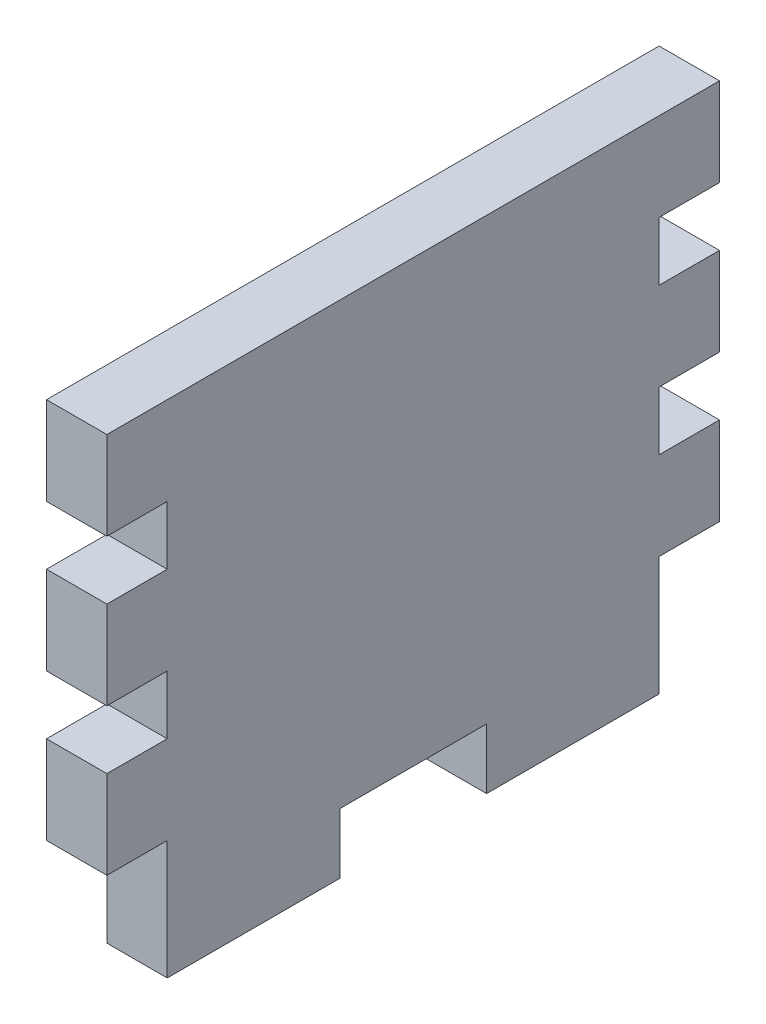
ISO-10303-21;
HEADER;
FILE_DESCRIPTION(('STEP AP214'),'2;1');
FILE_NAME('part.step','',(''),(''),'','','');
FILE_SCHEMA(('AUTOMOTIVE_DESIGN { 1 0 10303 214 1 1 1 1 }'));
ENDSEC;
DATA;
#1=APPLICATION_CONTEXT('core data for automotive mechanical design processes');
#2=APPLICATION_PROTOCOL_DEFINITION('international standard','automotive_design',2000,#1);
#3=PRODUCT_CONTEXT('',#1,'mechanical');
#4=PRODUCT('Part','Part','',(#3));
#5=PRODUCT_RELATED_PRODUCT_CATEGORY('part','',(#4));
#6=PRODUCT_DEFINITION_FORMATION('','',#4);
#7=PRODUCT_DEFINITION_CONTEXT('part definition',#1,'design');
#8=PRODUCT_DEFINITION('design','',#6,#7);
#9=PRODUCT_DEFINITION_SHAPE('','',#8);
#10=(LENGTH_UNIT() NAMED_UNIT(*) SI_UNIT(.MILLI.,.METRE.));
#11=(NAMED_UNIT(*) PLANE_ANGLE_UNIT() SI_UNIT($,.RADIAN.));
#12=(NAMED_UNIT(*) SI_UNIT($,.STERADIAN.) SOLID_ANGLE_UNIT());
#13=UNCERTAINTY_MEASURE_WITH_UNIT(LENGTH_MEASURE(1.E-05),#10,'distance_accuracy_value','');
#14=(GEOMETRIC_REPRESENTATION_CONTEXT(3) GLOBAL_UNCERTAINTY_ASSIGNED_CONTEXT((#13)) GLOBAL_UNIT_ASSIGNED_CONTEXT((#10,
#11,#12)) REPRESENTATION_CONTEXT('',''));
#15=CARTESIAN_POINT('',(0.,0.,0.));
#16=DIRECTION('',(0.,0.,1.));
#17=DIRECTION('',(1.,0.,0.));
#18=AXIS2_PLACEMENT_3D('',#15,#16,#17);
#19=CARTESIAN_POINT('',(11.15,-123.833512511459,0.));
#20=DIRECTION('',(0.,-1.,0.));
#21=DIRECTION('',(0.,0.,-1.));
#22=AXIS2_PLACEMENT_3D('',#19,#20,#21);
#23=PLANE('',#22);
#24=DIRECTION('',(1.,0.,0.));
#25=VECTOR('',#24,1.);
#26=CARTESIAN_POINT('',(15.26,-123.833512511459,16.75));
#27=LINE('',#26,#25);
#28=CARTESIAN_POINT('',(11.15,-123.833512511459,16.75));
#29=VERTEX_POINT('',#28);
#30=CARTESIAN_POINT('',(15.26,-123.833512511459,16.75));
#31=VERTEX_POINT('',#30);
#32=EDGE_CURVE('E403',#29,#31,#27,.T.);
#33=ORIENTED_EDGE('',*,*,#32,.F.);
#34=DIRECTION('',(0.,0.,-1.));
#35=VECTOR('',#34,1.);
#36=CARTESIAN_POINT('',(11.15,-123.833512511459,0.));
#37=LINE('',#36,#35);
#38=CARTESIAN_POINT('',(11.15,-123.833512511459,5.));
#39=VERTEX_POINT('',#38);
#40=EDGE_CURVE('E418',#29,#39,#37,.T.);
#41=ORIENTED_EDGE('',*,*,#40,.T.);
#42=DIRECTION('',(1.,0.,0.));
#43=VECTOR('',#42,1.);
#44=CARTESIAN_POINT('',(11.15,-123.833512511459,5.));
#45=LINE('',#44,#43);
#46=CARTESIAN_POINT('',(15.26,-123.833512511459,5.));
#47=VERTEX_POINT('',#46);
#48=EDGE_CURVE('E323',#39,#47,#45,.T.);
#49=ORIENTED_EDGE('',*,*,#48,.T.);
#50=DIRECTION('',(0.,0.,-1.));
#51=VECTOR('',#50,1.);
#52=CARTESIAN_POINT('',(15.26,-123.833512511459,0.));
#53=LINE('',#52,#51);
#54=EDGE_CURVE('E292',#31,#47,#53,.T.);
#55=ORIENTED_EDGE('',*,*,#54,.F.);
#56=EDGE_LOOP('',(#33,#41,#49,#55));
#57=FACE_BOUND('',#56,.T.);
#58=ADVANCED_FACE('F35',(#57),#23,.T.);
#59=CARTESIAN_POINT('',(11.15,-99.7235125114591,0.));
#60=DIRECTION('',(0.,1.,0.));
#61=DIRECTION('',(0.,0.,1.));
#62=AXIS2_PLACEMENT_3D('',#59,#60,#61);
#63=PLANE('',#62);
#64=DIRECTION('',(0.,0.,1.));
#65=VECTOR('',#64,1.);
#66=CARTESIAN_POINT('',(15.26,-99.7235125114591,0.));
#67=LINE('',#66,#65);
#68=CARTESIAN_POINT('',(15.26,-99.7235125114591,0.890000000000009));
#69=VERTEX_POINT('',#68);
#70=CARTESIAN_POINT('',(15.26,-99.7235125114591,5.));
#71=VERTEX_POINT('',#70);
#72=EDGE_CURVE('E243',#69,#71,#67,.T.);
#73=ORIENTED_EDGE('',*,*,#72,.F.);
#74=DIRECTION('',(1.,0.,0.));
#75=VECTOR('',#74,1.);
#76=CARTESIAN_POINT('',(11.15,-99.7235125114591,0.890000000000009));
#77=LINE('',#76,#75);
#78=CARTESIAN_POINT('',(11.15,-99.7235125114591,0.890000000000009));
#79=VERTEX_POINT('',#78);
#80=EDGE_CURVE('E11',#79,#69,#77,.T.);
#81=ORIENTED_EDGE('',*,*,#80,.F.);
#82=DIRECTION('',(0.,0.,1.));
#83=VECTOR('',#82,1.);
#84=CARTESIAN_POINT('',(11.15,-99.7235125114591,0.));
#85=LINE('',#84,#83);
#86=CARTESIAN_POINT('',(11.15,-99.7235125114591,5.));
#87=VERTEX_POINT('',#86);
#88=EDGE_CURVE('E313',#79,#87,#85,.T.);
#89=ORIENTED_EDGE('',*,*,#88,.T.);
#90=DIRECTION('',(1.,0.,0.));
#91=VECTOR('',#90,1.);
#92=CARTESIAN_POINT('',(11.15,-99.7235125114591,5.));
#93=LINE('',#92,#91);
#94=EDGE_CURVE('E39',#87,#71,#93,.T.);
#95=ORIENTED_EDGE('',*,*,#94,.T.);
#96=EDGE_LOOP('',(#73,#81,#89,#95));
#97=FACE_BOUND('',#96,.T.);
#98=ADVANCED_FACE('F37',(#97),#63,.T.);
#99=CARTESIAN_POINT('',(11.15,0.,0.890000000000124));
#100=DIRECTION('',(0.,0.,-1.));
#101=DIRECTION('',(0.,1.,0.));
#102=AXIS2_PLACEMENT_3D('',#99,#100,#101);
#103=PLANE('',#102);
#104=DIRECTION('',(0.,1.,0.));
#105=VECTOR('',#104,1.);
#106=CARTESIAN_POINT('',(15.26,0.,0.890000000000124));
#107=LINE('',#106,#105);
#108=CARTESIAN_POINT('',(15.26,-105.723512511459,0.890000000000002));
#109=VERTEX_POINT('',#108);
#110=EDGE_CURVE('E311',#109,#69,#107,.T.);
#111=ORIENTED_EDGE('',*,*,#110,.F.);
#112=DIRECTION('',(1.,0.,0.));
#113=VECTOR('',#112,1.);
#114=CARTESIAN_POINT('',(11.15,-105.723512511459,0.890000000000002));
#115=LINE('',#114,#113);
#116=CARTESIAN_POINT('',(11.15,-105.723512511459,0.890000000000002));
#117=VERTEX_POINT('',#116);
#118=EDGE_CURVE('E44',#117,#109,#115,.T.);
#119=ORIENTED_EDGE('',*,*,#118,.F.);
#120=DIRECTION('',(0.,1.,0.));
#121=VECTOR('',#120,1.);
#122=CARTESIAN_POINT('',(11.15,0.,0.890000000000124));
#123=LINE('',#122,#121);
#124=EDGE_CURVE('E233',#117,#79,#123,.T.);
#125=ORIENTED_EDGE('',*,*,#124,.T.);
#126=ORIENTED_EDGE('',*,*,#80,.T.);
#127=EDGE_LOOP('',(#111,#119,#125,#126));
#128=FACE_BOUND('',#127,.T.);
#129=ADVANCED_FACE('F359',(#128),#103,.T.);
#130=CARTESIAN_POINT('',(11.15,-105.723512511459,0.));
#131=DIRECTION('',(0.,-1.,0.));
#132=DIRECTION('',(0.,0.,-1.));
#133=AXIS2_PLACEMENT_3D('',#130,#131,#132);
#134=PLANE('',#133);
#135=DIRECTION('',(0.,0.,-1.));
#136=VECTOR('',#135,1.);
#137=CARTESIAN_POINT('',(15.26,-105.723512511459,0.));
#138=LINE('',#137,#136);
#139=CARTESIAN_POINT('',(15.26,-105.723512511459,5.));
#140=VERTEX_POINT('',#139);
#141=EDGE_CURVE('E219',#140,#109,#138,.T.);
#142=ORIENTED_EDGE('',*,*,#141,.F.);
#143=DIRECTION('',(1.,0.,0.));
#144=VECTOR('',#143,1.);
#145=CARTESIAN_POINT('',(11.15,-105.723512511459,5.));
#146=LINE('',#145,#144);
#147=CARTESIAN_POINT('',(11.15,-105.723512511459,5.));
#148=VERTEX_POINT('',#147);
#149=EDGE_CURVE('E213',#148,#140,#146,.T.);
#150=ORIENTED_EDGE('',*,*,#149,.F.);
#151=DIRECTION('',(0.,0.,-1.));
#152=VECTOR('',#151,1.);
#153=CARTESIAN_POINT('',(11.15,-105.723512511459,0.));
#154=LINE('',#153,#152);
#155=EDGE_CURVE('E216',#148,#117,#154,.T.);
#156=ORIENTED_EDGE('',*,*,#155,.T.);
#157=ORIENTED_EDGE('',*,*,#118,.T.);
#158=EDGE_LOOP('',(#142,#150,#156,#157));
#159=FACE_BOUND('',#158,.T.);
#160=ADVANCED_FACE('F215',(#159),#134,.T.);
#161=CARTESIAN_POINT('',(11.15,0.,5.));
#162=DIRECTION('',(0.,0.,-1.));
#163=DIRECTION('',(-1.,0.,0.));
#164=AXIS2_PLACEMENT_3D('',#161,#162,#163);
#165=PLANE('',#164);
#166=DIRECTION('',(0.,1.,0.));
#167=VECTOR('',#166,1.);
#168=CARTESIAN_POINT('',(15.26,0.,5.));
#169=LINE('',#168,#167);
#170=CARTESIAN_POINT('',(15.26,-109.723512511459,5.));
#171=VERTEX_POINT('',#170);
#172=EDGE_CURVE('E308',#171,#140,#169,.T.);
#173=ORIENTED_EDGE('',*,*,#172,.F.);
#174=DIRECTION('',(1.,0.,0.));
#175=VECTOR('',#174,1.);
#176=CARTESIAN_POINT('',(11.15,-109.723512511459,5.));
#177=LINE('',#176,#175);
#178=CARTESIAN_POINT('',(11.15,-109.723512511459,5.));
#179=VERTEX_POINT('',#178);
#180=EDGE_CURVE('E224',#179,#171,#177,.T.);
#181=ORIENTED_EDGE('',*,*,#180,.F.);
#182=DIRECTION('',(0.,1.,0.));
#183=VECTOR('',#182,1.);
#184=CARTESIAN_POINT('',(11.15,0.,5.));
#185=LINE('',#184,#183);
#186=EDGE_CURVE('E231',#179,#148,#185,.T.);
#187=ORIENTED_EDGE('',*,*,#186,.T.);
#188=ORIENTED_EDGE('',*,*,#149,.T.);
#189=EDGE_LOOP('',(#173,#181,#187,#188));
#190=FACE_BOUND('',#189,.T.);
#191=ADVANCED_FACE('F235',(#190),#165,.T.);
#192=CARTESIAN_POINT('',(11.15,-109.723512511459,0.));
#193=DIRECTION('',(0.,1.,0.));
#194=DIRECTION('',(0.,0.,1.));
#195=AXIS2_PLACEMENT_3D('',#192,#193,#194);
#196=PLANE('',#195);
#197=DIRECTION('',(0.,0.,1.));
#198=VECTOR('',#197,1.);
#199=CARTESIAN_POINT('',(15.26,-109.723512511459,0.));
#200=LINE('',#199,#198);
#201=CARTESIAN_POINT('',(15.26,-109.723512511459,0.889999999999995));
#202=VERTEX_POINT('',#201);
#203=EDGE_CURVE('E305',#202,#171,#200,.T.);
#204=ORIENTED_EDGE('',*,*,#203,.F.);
#205=DIRECTION('',(1.,0.,0.));
#206=VECTOR('',#205,1.);
#207=CARTESIAN_POINT('',(11.15,-109.723512511459,0.889999999999995));
#208=LINE('',#207,#206);
#209=CARTESIAN_POINT('',(11.15,-109.723512511459,0.889999999999995));
#210=VERTEX_POINT('',#209);
#211=EDGE_CURVE('E317',#210,#202,#208,.T.);
#212=ORIENTED_EDGE('',*,*,#211,.F.);
#213=DIRECTION('',(0.,0.,1.));
#214=VECTOR('',#213,1.);
#215=CARTESIAN_POINT('',(11.15,-109.723512511459,0.));
#216=LINE('',#215,#214);
#217=EDGE_CURVE('E236',#210,#179,#216,.T.);
#218=ORIENTED_EDGE('',*,*,#217,.T.);
#219=ORIENTED_EDGE('',*,*,#180,.T.);
#220=EDGE_LOOP('',(#204,#212,#218,#219));
#221=FACE_BOUND('',#220,.T.);
#222=ADVANCED_FACE('F587',(#221),#196,.T.);
#223=CARTESIAN_POINT('',(11.15,0.,0.889999999999995));
#224=DIRECTION('',(0.,0.,-1.));
#225=DIRECTION('',(-1.,0.,0.));
#226=AXIS2_PLACEMENT_3D('',#223,#224,#225);
#227=PLANE('',#226);
#228=DIRECTION('',(0.,1.,0.));
#229=VECTOR('',#228,1.);
#230=CARTESIAN_POINT('',(15.26,0.,0.889999999999995));
#231=LINE('',#230,#229);
#232=CARTESIAN_POINT('',(15.26,-115.723512511459,0.889999999999995));
#233=VERTEX_POINT('',#232);
#234=EDGE_CURVE('E302',#233,#202,#231,.T.);
#235=ORIENTED_EDGE('',*,*,#234,.F.);
#236=DIRECTION('',(1.,0.,0.));
#237=VECTOR('',#236,1.);
#238=CARTESIAN_POINT('',(11.15,-115.723512511459,0.889999999999995));
#239=LINE('',#238,#237);
#240=CARTESIAN_POINT('',(11.15,-115.723512511459,0.889999999999995));
#241=VERTEX_POINT('',#240);
#242=EDGE_CURVE('E319',#241,#233,#239,.T.);
#243=ORIENTED_EDGE('',*,*,#242,.F.);
#244=DIRECTION('',(0.,1.,0.));
#245=VECTOR('',#244,1.);
#246=CARTESIAN_POINT('',(11.15,0.,0.889999999999995));
#247=LINE('',#246,#245);
#248=EDGE_CURVE('E238',#241,#210,#247,.T.);
#249=ORIENTED_EDGE('',*,*,#248,.T.);
#250=ORIENTED_EDGE('',*,*,#211,.T.);
#251=EDGE_LOOP('',(#235,#243,#249,#250));
#252=FACE_BOUND('',#251,.T.);
#253=ADVANCED_FACE('F431',(#252),#227,.T.);
#254=CARTESIAN_POINT('',(11.15,-115.723512511459,0.));
#255=DIRECTION('',(0.,-1.,0.));
#256=DIRECTION('',(0.,0.,-1.));
#257=AXIS2_PLACEMENT_3D('',#254,#255,#256);
#258=PLANE('',#257);
#259=DIRECTION('',(0.,0.,-1.));
#260=VECTOR('',#259,1.);
#261=CARTESIAN_POINT('',(15.26,-115.723512511459,0.));
#262=LINE('',#261,#260);
#263=CARTESIAN_POINT('',(15.26,-115.723512511459,5.));
#264=VERTEX_POINT('',#263);
#265=EDGE_CURVE('E299',#264,#233,#262,.T.);
#266=ORIENTED_EDGE('',*,*,#265,.F.);
#267=DIRECTION('',(1.,0.,0.));
#268=VECTOR('',#267,1.);
#269=CARTESIAN_POINT('',(11.15,-115.723512511459,5.));
#270=LINE('',#269,#268);
#271=CARTESIAN_POINT('',(11.15,-115.723512511459,5.));
#272=VERTEX_POINT('',#271);
#273=EDGE_CURVE('E321',#272,#264,#270,.T.);
#274=ORIENTED_EDGE('',*,*,#273,.F.);
#275=DIRECTION('',(0.,0.,-1.));
#276=VECTOR('',#275,1.);
#277=CARTESIAN_POINT('',(11.15,-115.723512511459,0.));
#278=LINE('',#277,#276);
#279=EDGE_CURVE('E421',#272,#241,#278,.T.);
#280=ORIENTED_EDGE('',*,*,#279,.T.);
#281=ORIENTED_EDGE('',*,*,#242,.T.);
#282=EDGE_LOOP('',(#266,#274,#280,#281));
#283=FACE_BOUND('',#282,.T.);
#284=ADVANCED_FACE('F387',(#283),#258,.T.);
#285=CARTESIAN_POINT('',(11.15,0.,5.));
#286=DIRECTION('',(0.,0.,-1.));
#287=DIRECTION('',(-1.,0.,0.));
#288=AXIS2_PLACEMENT_3D('',#285,#286,#287);
#289=PLANE('',#288);
#290=DIRECTION('',(0.,1.,0.));
#291=VECTOR('',#290,1.);
#292=CARTESIAN_POINT('',(15.26,0.,5.));
#293=LINE('',#292,#291);
#294=EDGE_CURVE('E296',#47,#264,#293,.T.);
#295=ORIENTED_EDGE('',*,*,#294,.F.);
#296=ORIENTED_EDGE('',*,*,#48,.F.);
#297=DIRECTION('',(0.,1.,0.));
#298=VECTOR('',#297,1.);
#299=CARTESIAN_POINT('',(11.15,0.,5.));
#300=LINE('',#299,#298);
#301=EDGE_CURVE('E417',#39,#272,#300,.T.);
#302=ORIENTED_EDGE('',*,*,#301,.T.);
#303=ORIENTED_EDGE('',*,*,#273,.T.);
#304=EDGE_LOOP('',(#295,#296,#302,#303));
#305=FACE_BOUND('',#304,.T.);
#306=ADVANCED_FACE('F379',(#305),#289,.T.);
#307=DIRECTION('',(-1.,0.,0.));
#308=VECTOR('',#307,1.);
#309=CARTESIAN_POINT('',(15.26,-123.833512511459,26.75));
#310=LINE('',#309,#308);
#311=CARTESIAN_POINT('',(15.26,-123.833512511459,26.75));
#312=VERTEX_POINT('',#311);
#313=CARTESIAN_POINT('',(11.15,-123.833512511459,26.75));
#314=VERTEX_POINT('',#313);
#315=EDGE_CURVE('E394',#312,#314,#310,.T.);
#316=ORIENTED_EDGE('',*,*,#315,.F.);
#317=CARTESIAN_POINT('',(15.26,-123.833512511459,38.5));
#318=VERTEX_POINT('',#317);
#319=EDGE_CURVE('E293',#318,#312,#53,.T.);
#320=ORIENTED_EDGE('',*,*,#319,.F.);
#321=DIRECTION('',(1.,0.,0.));
#322=VECTOR('',#321,1.);
#323=CARTESIAN_POINT('',(11.15,-123.833512511459,38.5));
#324=LINE('',#323,#322);
#325=CARTESIAN_POINT('',(11.15,-123.833512511459,38.5));
#326=VERTEX_POINT('',#325);
#327=EDGE_CURVE('E326',#326,#318,#324,.T.);
#328=ORIENTED_EDGE('',*,*,#327,.F.);
#329=EDGE_CURVE('E397',#326,#314,#37,.T.);
#330=ORIENTED_EDGE('',*,*,#329,.T.);
#331=EDGE_LOOP('',(#316,#320,#328,#330));
#332=FACE_BOUND('',#331,.T.);
#333=ADVANCED_FACE('F371',(#332),#23,.T.);
#334=CARTESIAN_POINT('',(11.15,0.,38.5));
#335=DIRECTION('',(0.,0.,1.));
#336=DIRECTION('',(1.,0.,0.));
#337=AXIS2_PLACEMENT_3D('',#334,#335,#336);
#338=PLANE('',#337);
#339=DIRECTION('',(0.,-1.,0.));
#340=VECTOR('',#339,1.);
#341=CARTESIAN_POINT('',(15.26,0.,38.5));
#342=LINE('',#341,#340);
#343=CARTESIAN_POINT('',(15.26,-115.723512511459,38.5));
#344=VERTEX_POINT('',#343);
#345=EDGE_CURVE('E289',#344,#318,#342,.T.);
#346=ORIENTED_EDGE('',*,*,#345,.F.);
#347=DIRECTION('',(1.,0.,0.));
#348=VECTOR('',#347,1.);
#349=CARTESIAN_POINT('',(11.15,-115.723512511459,38.5));
#350=LINE('',#349,#348);
#351=CARTESIAN_POINT('',(11.15,-115.723512511459,38.5));
#352=VERTEX_POINT('',#351);
#353=EDGE_CURVE('E328',#352,#344,#350,.T.);
#354=ORIENTED_EDGE('',*,*,#353,.F.);
#355=DIRECTION('',(0.,-1.,0.));
#356=VECTOR('',#355,1.);
#357=CARTESIAN_POINT('',(11.15,0.,38.5));
#358=LINE('',#357,#356);
#359=EDGE_CURVE('E414',#352,#326,#358,.T.);
#360=ORIENTED_EDGE('',*,*,#359,.T.);
#361=ORIENTED_EDGE('',*,*,#327,.T.);
#362=EDGE_LOOP('',(#346,#354,#360,#361));
#363=FACE_BOUND('',#362,.T.);
#364=ADVANCED_FACE('F378',(#363),#338,.T.);
#365=CARTESIAN_POINT('',(11.15,-115.723512511459,0.));
#366=DIRECTION('',(0.,1.,0.));
#367=DIRECTION('',(0.,0.,1.));
#368=AXIS2_PLACEMENT_3D('',#365,#366,#367);
#369=PLANE('',#368);
#370=DIRECTION('',(0.,0.,1.));
#371=VECTOR('',#370,1.);
#372=CARTESIAN_POINT('',(15.26,-115.723512511459,0.));
#373=LINE('',#372,#371);
#374=CARTESIAN_POINT('',(15.26,-115.723512511459,42.61));
#375=VERTEX_POINT('',#374);
#376=EDGE_CURVE('E286',#344,#375,#373,.T.);
#377=ORIENTED_EDGE('',*,*,#376,.T.);
#378=DIRECTION('',(1.,0.,0.));
#379=VECTOR('',#378,1.);
#380=CARTESIAN_POINT('',(11.15,-115.723512511459,42.61));
#381=LINE('',#380,#379);
#382=CARTESIAN_POINT('',(11.15,-115.723512511459,42.61));
#383=VERTEX_POINT('',#382);
#384=EDGE_CURVE('E330',#383,#375,#381,.T.);
#385=ORIENTED_EDGE('',*,*,#384,.F.);
#386=DIRECTION('',(0.,0.,1.));
#387=VECTOR('',#386,1.);
#388=CARTESIAN_POINT('',(11.15,-115.723512511459,0.));
#389=LINE('',#388,#387);
#390=EDGE_CURVE('E490',#352,#383,#389,.T.);
#391=ORIENTED_EDGE('',*,*,#390,.F.);
#392=ORIENTED_EDGE('',*,*,#353,.T.);
#393=EDGE_LOOP('',(#377,#385,#391,#392));
#394=FACE_BOUND('',#393,.T.);
#395=ADVANCED_FACE('F385',(#394),#369,.F.);
#396=CARTESIAN_POINT('',(11.15,0.,42.61));
#397=DIRECTION('',(0.,0.,1.));
#398=DIRECTION('',(1.,0.,0.));
#399=AXIS2_PLACEMENT_3D('',#396,#397,#398);
#400=PLANE('',#399);
#401=DIRECTION('',(0.,-1.,0.));
#402=VECTOR('',#401,1.);
#403=CARTESIAN_POINT('',(15.26,0.,42.61));
#404=LINE('',#403,#402);
#405=CARTESIAN_POINT('',(15.26,-109.723512511459,42.61));
#406=VERTEX_POINT('',#405);
#407=EDGE_CURVE('E283',#406,#375,#404,.T.);
#408=ORIENTED_EDGE('',*,*,#407,.F.);
#409=DIRECTION('',(1.,0.,0.));
#410=VECTOR('',#409,1.);
#411=CARTESIAN_POINT('',(11.15,-109.723512511459,42.61));
#412=LINE('',#411,#410);
#413=CARTESIAN_POINT('',(11.15,-109.723512511459,42.61));
#414=VERTEX_POINT('',#413);
#415=EDGE_CURVE('E332',#414,#406,#412,.T.);
#416=ORIENTED_EDGE('',*,*,#415,.F.);
#417=DIRECTION('',(0.,-1.,0.));
#418=VECTOR('',#417,1.);
#419=CARTESIAN_POINT('',(11.15,0.,42.61));
#420=LINE('',#419,#418);
#421=EDGE_CURVE('E488',#414,#383,#420,.T.);
#422=ORIENTED_EDGE('',*,*,#421,.T.);
#423=ORIENTED_EDGE('',*,*,#384,.T.);
#424=EDGE_LOOP('',(#408,#416,#422,#423));
#425=FACE_BOUND('',#424,.T.);
#426=ADVANCED_FACE('F496',(#425),#400,.T.);
#427=CARTESIAN_POINT('',(11.15,-109.723512511459,0.));
#428=DIRECTION('',(0.,-1.,0.));
#429=DIRECTION('',(0.,0.,-1.));
#430=AXIS2_PLACEMENT_3D('',#427,#428,#429);
#431=PLANE('',#430);
#432=DIRECTION('',(0.,0.,-1.));
#433=VECTOR('',#432,1.);
#434=CARTESIAN_POINT('',(15.26,-109.723512511459,0.));
#435=LINE('',#434,#433);
#436=CARTESIAN_POINT('',(15.26,-109.723512511459,38.5));
#437=VERTEX_POINT('',#436);
#438=EDGE_CURVE('E280',#406,#437,#435,.T.);
#439=ORIENTED_EDGE('',*,*,#438,.T.);
#440=DIRECTION('',(1.,0.,0.));
#441=VECTOR('',#440,1.);
#442=CARTESIAN_POINT('',(11.15,-109.723512511459,38.5));
#443=LINE('',#442,#441);
#444=CARTESIAN_POINT('',(11.15,-109.723512511459,38.5));
#445=VERTEX_POINT('',#444);
#446=EDGE_CURVE('E334',#445,#437,#443,.T.);
#447=ORIENTED_EDGE('',*,*,#446,.F.);
#448=DIRECTION('',(0.,0.,-1.));
#449=VECTOR('',#448,1.);
#450=CARTESIAN_POINT('',(11.15,-109.723512511459,0.));
#451=LINE('',#450,#449);
#452=EDGE_CURVE('E486',#414,#445,#451,.T.);
#453=ORIENTED_EDGE('',*,*,#452,.F.);
#454=ORIENTED_EDGE('',*,*,#415,.T.);
#455=EDGE_LOOP('',(#439,#447,#453,#454));
#456=FACE_BOUND('',#455,.T.);
#457=ADVANCED_FACE('F501',(#456),#431,.F.);
#458=CARTESIAN_POINT('',(11.15,0.,38.5));
#459=DIRECTION('',(0.,0.,1.));
#460=DIRECTION('',(1.,0.,0.));
#461=AXIS2_PLACEMENT_3D('',#458,#459,#460);
#462=PLANE('',#461);
#463=DIRECTION('',(0.,-1.,0.));
#464=VECTOR('',#463,1.);
#465=CARTESIAN_POINT('',(15.26,0.,38.5));
#466=LINE('',#465,#464);
#467=CARTESIAN_POINT('',(15.26,-105.723512511459,38.5));
#468=VERTEX_POINT('',#467);
#469=EDGE_CURVE('E277',#468,#437,#466,.T.);
#470=ORIENTED_EDGE('',*,*,#469,.F.);
#471=DIRECTION('',(1.,0.,0.));
#472=VECTOR('',#471,1.);
#473=CARTESIAN_POINT('',(11.15,-105.723512511459,38.5));
#474=LINE('',#473,#472);
#475=CARTESIAN_POINT('',(11.15,-105.723512511459,38.5));
#476=VERTEX_POINT('',#475);
#477=EDGE_CURVE('E336',#476,#468,#474,.T.);
#478=ORIENTED_EDGE('',*,*,#477,.F.);
#479=DIRECTION('',(0.,-1.,0.));
#480=VECTOR('',#479,1.);
#481=CARTESIAN_POINT('',(11.15,0.,38.5));
#482=LINE('',#481,#480);
#483=EDGE_CURVE('E483',#476,#445,#482,.T.);
#484=ORIENTED_EDGE('',*,*,#483,.T.);
#485=ORIENTED_EDGE('',*,*,#446,.T.);
#486=EDGE_LOOP('',(#470,#478,#484,#485));
#487=FACE_BOUND('',#486,.T.);
#488=ADVANCED_FACE('F508',(#487),#462,.T.);
#489=CARTESIAN_POINT('',(11.15,-105.723512511459,0.));
#490=DIRECTION('',(0.,1.,0.));
#491=DIRECTION('',(0.,0.,1.));
#492=AXIS2_PLACEMENT_3D('',#489,#490,#491);
#493=PLANE('',#492);
#494=DIRECTION('',(0.,0.,1.));
#495=VECTOR('',#494,1.);
#496=CARTESIAN_POINT('',(15.26,-105.723512511459,0.));
#497=LINE('',#496,#495);
#498=CARTESIAN_POINT('',(15.26,-105.723512511459,42.61));
#499=VERTEX_POINT('',#498);
#500=EDGE_CURVE('E274',#468,#499,#497,.T.);
#501=ORIENTED_EDGE('',*,*,#500,.T.);
#502=DIRECTION('',(1.,0.,0.));
#503=VECTOR('',#502,1.);
#504=CARTESIAN_POINT('',(11.15,-105.723512511459,42.61));
#505=LINE('',#504,#503);
#506=CARTESIAN_POINT('',(11.15,-105.723512511459,42.61));
#507=VERTEX_POINT('',#506);
#508=EDGE_CURVE('E338',#507,#499,#505,.T.);
#509=ORIENTED_EDGE('',*,*,#508,.F.);
#510=DIRECTION('',(0.,0.,1.));
#511=VECTOR('',#510,1.);
#512=CARTESIAN_POINT('',(11.15,-105.723512511459,0.));
#513=LINE('',#512,#511);
#514=EDGE_CURVE('E481',#476,#507,#513,.T.);
#515=ORIENTED_EDGE('',*,*,#514,.F.);
#516=ORIENTED_EDGE('',*,*,#477,.T.);
#517=EDGE_LOOP('',(#501,#509,#515,#516));
#518=FACE_BOUND('',#517,.T.);
#519=ADVANCED_FACE('F511',(#518),#493,.F.);
#520=CARTESIAN_POINT('',(11.15,0.,42.61));
#521=DIRECTION('',(0.,0.,1.));
#522=DIRECTION('',(1.,0.,0.));
#523=AXIS2_PLACEMENT_3D('',#520,#521,#522);
#524=PLANE('',#523);
#525=DIRECTION('',(0.,-1.,0.));
#526=VECTOR('',#525,1.);
#527=CARTESIAN_POINT('',(15.26,0.,42.61));
#528=LINE('',#527,#526);
#529=CARTESIAN_POINT('',(15.26,-99.7235125114591,42.61));
#530=VERTEX_POINT('',#529);
#531=EDGE_CURVE('E271',#530,#499,#528,.T.);
#532=ORIENTED_EDGE('',*,*,#531,.F.);
#533=DIRECTION('',(1.,0.,0.));
#534=VECTOR('',#533,1.);
#535=CARTESIAN_POINT('',(11.15,-99.7235125114591,42.61));
#536=LINE('',#535,#534);
#537=CARTESIAN_POINT('',(11.15,-99.7235125114591,42.61));
#538=VERTEX_POINT('',#537);
#539=EDGE_CURVE('E340',#538,#530,#536,.T.);
#540=ORIENTED_EDGE('',*,*,#539,.F.);
#541=DIRECTION('',(0.,-1.,0.));
#542=VECTOR('',#541,1.);
#543=CARTESIAN_POINT('',(11.15,0.,42.61));
#544=LINE('',#543,#542);
#545=EDGE_CURVE('E478',#538,#507,#544,.T.);
#546=ORIENTED_EDGE('',*,*,#545,.T.);
#547=ORIENTED_EDGE('',*,*,#508,.T.);
#548=EDGE_LOOP('',(#532,#540,#546,#547));
#549=FACE_BOUND('',#548,.T.);
#550=ADVANCED_FACE('F514',(#549),#524,.T.);
#551=CARTESIAN_POINT('',(11.15,-99.7235125114591,0.));
#552=DIRECTION('',(0.,-1.,0.));
#553=DIRECTION('',(0.,0.,-1.));
#554=AXIS2_PLACEMENT_3D('',#551,#552,#553);
#555=PLANE('',#554);
#556=DIRECTION('',(0.,0.,-1.));
#557=VECTOR('',#556,1.);
#558=CARTESIAN_POINT('',(15.26,-99.7235125114591,0.));
#559=LINE('',#558,#557);
#560=CARTESIAN_POINT('',(15.26,-99.7235125114591,38.5));
#561=VERTEX_POINT('',#560);
#562=EDGE_CURVE('E268',#530,#561,#559,.T.);
#563=ORIENTED_EDGE('',*,*,#562,.T.);
#564=DIRECTION('',(1.,0.,0.));
#565=VECTOR('',#564,1.);
#566=CARTESIAN_POINT('',(11.15,-99.7235125114591,38.5));
#567=LINE('',#566,#565);
#568=CARTESIAN_POINT('',(11.15,-99.7235125114591,38.5));
#569=VERTEX_POINT('',#568);
#570=EDGE_CURVE('E342',#569,#561,#567,.T.);
#571=ORIENTED_EDGE('',*,*,#570,.F.);
#572=DIRECTION('',(0.,0.,-1.));
#573=VECTOR('',#572,1.);
#574=CARTESIAN_POINT('',(11.15,-99.7235125114591,0.));
#575=LINE('',#574,#573);
#576=EDGE_CURVE('E476',#538,#569,#575,.T.);
#577=ORIENTED_EDGE('',*,*,#576,.F.);
#578=ORIENTED_EDGE('',*,*,#539,.T.);
#579=EDGE_LOOP('',(#563,#571,#577,#578));
#580=FACE_BOUND('',#579,.T.);
#581=ADVANCED_FACE('F519',(#580),#555,.F.);
#582=CARTESIAN_POINT('',(11.15,0.,38.5));
#583=DIRECTION('',(0.,0.,1.));
#584=DIRECTION('',(1.,0.,0.));
#585=AXIS2_PLACEMENT_3D('',#582,#583,#584);
#586=PLANE('',#585);
#587=DIRECTION('',(0.,-1.,0.));
#588=VECTOR('',#587,1.);
#589=CARTESIAN_POINT('',(15.26,0.,38.5));
#590=LINE('',#589,#588);
#591=CARTESIAN_POINT('',(15.26,-95.7235125114591,38.5));
#592=VERTEX_POINT('',#591);
#593=EDGE_CURVE('E265',#592,#561,#590,.T.);
#594=ORIENTED_EDGE('',*,*,#593,.F.);
#595=DIRECTION('',(1.,0.,0.));
#596=VECTOR('',#595,1.);
#597=CARTESIAN_POINT('',(11.15,-95.7235125114591,38.5));
#598=LINE('',#597,#596);
#599=CARTESIAN_POINT('',(11.15,-95.7235125114591,38.5));
#600=VERTEX_POINT('',#599);
#601=EDGE_CURVE('E344',#600,#592,#598,.T.);
#602=ORIENTED_EDGE('',*,*,#601,.F.);
#603=DIRECTION('',(0.,-1.,0.));
#604=VECTOR('',#603,1.);
#605=CARTESIAN_POINT('',(11.15,0.,38.5));
#606=LINE('',#605,#604);
#607=EDGE_CURVE('E473',#600,#569,#606,.T.);
#608=ORIENTED_EDGE('',*,*,#607,.T.);
#609=ORIENTED_EDGE('',*,*,#570,.T.);
#610=EDGE_LOOP('',(#594,#602,#608,#609));
#611=FACE_BOUND('',#610,.T.);
#612=ADVANCED_FACE('F523',(#611),#586,.T.);
#613=CARTESIAN_POINT('',(11.15,-95.7235125114591,0.));
#614=DIRECTION('',(0.,1.,0.));
#615=DIRECTION('',(0.,0.,1.));
#616=AXIS2_PLACEMENT_3D('',#613,#614,#615);
#617=PLANE('',#616);
#618=DIRECTION('',(0.,0.,1.));
#619=VECTOR('',#618,1.);
#620=CARTESIAN_POINT('',(15.26,-95.7235125114591,0.));
#621=LINE('',#620,#619);
#622=CARTESIAN_POINT('',(15.26,-95.7235125114591,42.61));
#623=VERTEX_POINT('',#622);
#624=EDGE_CURVE('E262',#592,#623,#621,.T.);
#625=ORIENTED_EDGE('',*,*,#624,.T.);
#626=DIRECTION('',(1.,0.,0.));
#627=VECTOR('',#626,1.);
#628=CARTESIAN_POINT('',(11.15,-95.7235125114591,42.61));
#629=LINE('',#628,#627);
#630=CARTESIAN_POINT('',(11.15,-95.7235125114591,42.61));
#631=VERTEX_POINT('',#630);
#632=EDGE_CURVE('E346',#631,#623,#629,.T.);
#633=ORIENTED_EDGE('',*,*,#632,.F.);
#634=DIRECTION('',(0.,0.,1.));
#635=VECTOR('',#634,1.);
#636=CARTESIAN_POINT('',(11.15,-95.7235125114591,0.));
#637=LINE('',#636,#635);
#638=EDGE_CURVE('E471',#600,#631,#637,.T.);
#639=ORIENTED_EDGE('',*,*,#638,.F.);
#640=ORIENTED_EDGE('',*,*,#601,.T.);
#641=EDGE_LOOP('',(#625,#633,#639,#640));
#642=FACE_BOUND('',#641,.T.);
#643=ADVANCED_FACE('F528',(#642),#617,.F.);
#644=CARTESIAN_POINT('',(11.15,0.,42.61));
#645=DIRECTION('',(0.,0.,1.));
#646=DIRECTION('',(1.,0.,0.));
#647=AXIS2_PLACEMENT_3D('',#644,#645,#646);
#648=PLANE('',#647);
#649=DIRECTION('',(0.,-1.,0.));
#650=VECTOR('',#649,1.);
#651=CARTESIAN_POINT('',(15.26,0.,42.61));
#652=LINE('',#651,#650);
#653=CARTESIAN_POINT('',(15.26,-89.7235125114591,42.61));
#654=VERTEX_POINT('',#653);
#655=EDGE_CURVE('E259',#654,#623,#652,.T.);
#656=ORIENTED_EDGE('',*,*,#655,.F.);
#657=DIRECTION('',(1.,0.,0.));
#658=VECTOR('',#657,1.);
#659=CARTESIAN_POINT('',(11.15,-89.7235125114591,42.61));
#660=LINE('',#659,#658);
#661=CARTESIAN_POINT('',(11.15,-89.7235125114591,42.61));
#662=VERTEX_POINT('',#661);
#663=EDGE_CURVE('E348',#662,#654,#660,.T.);
#664=ORIENTED_EDGE('',*,*,#663,.F.);
#665=DIRECTION('',(0.,-1.,0.));
#666=VECTOR('',#665,1.);
#667=CARTESIAN_POINT('',(11.15,0.,42.61));
#668=LINE('',#667,#666);
#669=EDGE_CURVE('E468',#662,#631,#668,.T.);
#670=ORIENTED_EDGE('',*,*,#669,.T.);
#671=ORIENTED_EDGE('',*,*,#632,.T.);
#672=EDGE_LOOP('',(#656,#664,#670,#671));
#673=FACE_BOUND('',#672,.T.);
#674=ADVANCED_FACE('F543',(#673),#648,.T.);
#675=CARTESIAN_POINT('',(11.15,-89.7235125114591,0.));
#676=DIRECTION('',(0.,1.,0.));
#677=DIRECTION('',(0.,0.,1.));
#678=AXIS2_PLACEMENT_3D('',#675,#676,#677);
#679=PLANE('',#678);
#680=DIRECTION('',(0.,0.,1.));
#681=VECTOR('',#680,1.);
#682=CARTESIAN_POINT('',(15.26,-89.7235125114591,0.));
#683=LINE('',#682,#681);
#684=CARTESIAN_POINT('',(15.26,-89.7235125114591,0.890000000000002));
#685=VERTEX_POINT('',#684);
#686=EDGE_CURVE('E256',#685,#654,#683,.T.);
#687=ORIENTED_EDGE('',*,*,#686,.F.);
#688=DIRECTION('',(1.,0.,0.));
#689=VECTOR('',#688,1.);
#690=CARTESIAN_POINT('',(11.15,-89.7235125114591,0.890000000000002));
#691=LINE('',#690,#689);
#692=CARTESIAN_POINT('',(11.15,-89.7235125114591,0.890000000000002));
#693=VERTEX_POINT('',#692);
#694=EDGE_CURVE('E350',#693,#685,#691,.T.);
#695=ORIENTED_EDGE('',*,*,#694,.F.);
#696=DIRECTION('',(0.,0.,1.));
#697=VECTOR('',#696,1.);
#698=CARTESIAN_POINT('',(11.15,-89.7235125114591,0.));
#699=LINE('',#698,#697);
#700=EDGE_CURVE('E465',#693,#662,#699,.T.);
#701=ORIENTED_EDGE('',*,*,#700,.T.);
#702=ORIENTED_EDGE('',*,*,#663,.T.);
#703=EDGE_LOOP('',(#687,#695,#701,#702));
#704=FACE_BOUND('',#703,.T.);
#705=ADVANCED_FACE('F535',(#704),#679,.T.);
#706=CARTESIAN_POINT('',(11.15,0.,0.889999999999898));
#707=DIRECTION('',(0.,0.,-1.));
#708=DIRECTION('',(0.,1.,0.));
#709=AXIS2_PLACEMENT_3D('',#706,#707,#708);
#710=PLANE('',#709);
#711=DIRECTION('',(0.,1.,0.));
#712=VECTOR('',#711,1.);
#713=CARTESIAN_POINT('',(15.26,0.,0.889999999999898));
#714=LINE('',#713,#712);
#715=CARTESIAN_POINT('',(15.26,-95.7235125114591,0.890000000000009));
#716=VERTEX_POINT('',#715);
#717=EDGE_CURVE('E253',#716,#685,#714,.T.);
#718=ORIENTED_EDGE('',*,*,#717,.F.);
#719=DIRECTION('',(1.,0.,0.));
#720=VECTOR('',#719,1.);
#721=CARTESIAN_POINT('',(11.15,-95.7235125114591,0.890000000000009));
#722=LINE('',#721,#720);
#723=CARTESIAN_POINT('',(11.15,-95.7235125114591,0.890000000000009));
#724=VERTEX_POINT('',#723);
#725=EDGE_CURVE('E352',#724,#716,#722,.T.);
#726=ORIENTED_EDGE('',*,*,#725,.F.);
#727=DIRECTION('',(0.,1.,0.));
#728=VECTOR('',#727,1.);
#729=CARTESIAN_POINT('',(11.15,0.,0.889999999999898));
#730=LINE('',#729,#728);
#731=EDGE_CURVE('E462',#724,#693,#730,.T.);
#732=ORIENTED_EDGE('',*,*,#731,.T.);
#733=ORIENTED_EDGE('',*,*,#694,.T.);
#734=EDGE_LOOP('',(#718,#726,#732,#733));
#735=FACE_BOUND('',#734,.T.);
#736=ADVANCED_FACE('F539',(#735),#710,.T.);
#737=CARTESIAN_POINT('',(11.15,-95.7235125114591,0.));
#738=DIRECTION('',(0.,-1.,0.));
#739=DIRECTION('',(0.,0.,-1.));
#740=AXIS2_PLACEMENT_3D('',#737,#738,#739);
#741=PLANE('',#740);
#742=DIRECTION('',(0.,0.,-1.));
#743=VECTOR('',#742,1.);
#744=CARTESIAN_POINT('',(15.26,-95.7235125114591,0.));
#745=LINE('',#744,#743);
#746=CARTESIAN_POINT('',(15.26,-95.7235125114591,5.));
#747=VERTEX_POINT('',#746);
#748=EDGE_CURVE('E250',#747,#716,#745,.T.);
#749=ORIENTED_EDGE('',*,*,#748,.F.);
#750=DIRECTION('',(1.,0.,0.));
#751=VECTOR('',#750,1.);
#752=CARTESIAN_POINT('',(11.15,-95.7235125114591,5.));
#753=LINE('',#752,#751);
#754=CARTESIAN_POINT('',(11.15,-95.7235125114591,5.));
#755=VERTEX_POINT('',#754);
#756=EDGE_CURVE('E353',#755,#747,#753,.T.);
#757=ORIENTED_EDGE('',*,*,#756,.F.);
#758=DIRECTION('',(0.,0.,-1.));
#759=VECTOR('',#758,1.);
#760=CARTESIAN_POINT('',(11.15,-95.7235125114591,0.));
#761=LINE('',#760,#759);
#762=EDGE_CURVE('E459',#755,#724,#761,.T.);
#763=ORIENTED_EDGE('',*,*,#762,.T.);
#764=ORIENTED_EDGE('',*,*,#725,.T.);
#765=EDGE_LOOP('',(#749,#757,#763,#764));
#766=FACE_BOUND('',#765,.T.);
#767=ADVANCED_FACE('F542',(#766),#741,.T.);
#768=CARTESIAN_POINT('',(11.15,0.,5.));
#769=DIRECTION('',(0.,0.,-1.));
#770=DIRECTION('',(-1.,0.,0.));
#771=AXIS2_PLACEMENT_3D('',#768,#769,#770);
#772=PLANE('',#771);
#773=DIRECTION('',(0.,1.,0.));
#774=VECTOR('',#773,1.);
#775=CARTESIAN_POINT('',(15.26,0.,5.));
#776=LINE('',#775,#774);
#777=EDGE_CURVE('E246',#71,#747,#776,.T.);
#778=ORIENTED_EDGE('',*,*,#777,.F.);
#779=ORIENTED_EDGE('',*,*,#94,.F.);
#780=DIRECTION('',(0.,1.,0.));
#781=VECTOR('',#780,1.);
#782=CARTESIAN_POINT('',(11.15,0.,5.));
#783=LINE('',#782,#781);
#784=EDGE_CURVE('E457',#87,#755,#783,.T.);
#785=ORIENTED_EDGE('',*,*,#784,.T.);
#786=ORIENTED_EDGE('',*,*,#756,.T.);
#787=EDGE_LOOP('',(#778,#779,#785,#786));
#788=FACE_BOUND('',#787,.T.);
#789=ADVANCED_FACE('F355',(#788),#772,.T.);
#790=CARTESIAN_POINT('',(11.15,0.,0.));
#791=DIRECTION('',(1.,0.,0.));
#792=DIRECTION('',(0.,0.,-1.));
#793=AXIS2_PLACEMENT_3D('',#790,#791,#792);
#794=PLANE('',#793);
#795=ORIENTED_EDGE('',*,*,#40,.F.);
#796=DIRECTION('',(0.,-1.,0.));
#797=VECTOR('',#796,1.);
#798=CARTESIAN_POINT('',(11.15,-119.723512511459,16.75));
#799=LINE('',#798,#797);
#800=CARTESIAN_POINT('',(11.15,-119.723512511459,16.75));
#801=VERTEX_POINT('',#800);
#802=EDGE_CURVE('E442',#801,#29,#799,.T.);
#803=ORIENTED_EDGE('',*,*,#802,.F.);
#804=DIRECTION('',(0.,0.,-1.));
#805=VECTOR('',#804,1.);
#806=CARTESIAN_POINT('',(11.15,-119.723512511459,16.75));
#807=LINE('',#806,#805);
#808=CARTESIAN_POINT('',(11.15,-119.723512511459,26.75));
#809=VERTEX_POINT('',#808);
#810=EDGE_CURVE('E581',#809,#801,#807,.T.);
#811=ORIENTED_EDGE('',*,*,#810,.F.);
#812=DIRECTION('',(0.,-1.,0.));
#813=VECTOR('',#812,1.);
#814=CARTESIAN_POINT('',(11.15,-119.723512511459,26.75));
#815=LINE('',#814,#813);
#816=EDGE_CURVE('E416',#809,#314,#815,.T.);
#817=ORIENTED_EDGE('',*,*,#816,.T.);
#818=ORIENTED_EDGE('',*,*,#329,.F.);
#819=ORIENTED_EDGE('',*,*,#359,.F.);
#820=ORIENTED_EDGE('',*,*,#390,.T.);
#821=ORIENTED_EDGE('',*,*,#421,.F.);
#822=ORIENTED_EDGE('',*,*,#452,.T.);
#823=ORIENTED_EDGE('',*,*,#483,.F.);
#824=ORIENTED_EDGE('',*,*,#514,.T.);
#825=ORIENTED_EDGE('',*,*,#545,.F.);
#826=ORIENTED_EDGE('',*,*,#576,.T.);
#827=ORIENTED_EDGE('',*,*,#607,.F.);
#828=ORIENTED_EDGE('',*,*,#638,.T.);
#829=ORIENTED_EDGE('',*,*,#669,.F.);
#830=ORIENTED_EDGE('',*,*,#700,.F.);
#831=ORIENTED_EDGE('',*,*,#731,.F.);
#832=ORIENTED_EDGE('',*,*,#762,.F.);
#833=ORIENTED_EDGE('',*,*,#784,.F.);
#834=ORIENTED_EDGE('',*,*,#88,.F.);
#835=ORIENTED_EDGE('',*,*,#124,.F.);
#836=ORIENTED_EDGE('',*,*,#155,.F.);
#837=ORIENTED_EDGE('',*,*,#186,.F.);
#838=ORIENTED_EDGE('',*,*,#217,.F.);
#839=ORIENTED_EDGE('',*,*,#248,.F.);
#840=ORIENTED_EDGE('',*,*,#279,.F.);
#841=ORIENTED_EDGE('',*,*,#301,.F.);
#842=EDGE_LOOP('',(#795,#803,#811,#817,#818,#819,#820,#821,#822,#823,#824,#825,#826,#827,#828,
#829,#830,#831,#832,#833,#834,#835,#836,#837,#838,#839,#840,#841));
#843=FACE_BOUND('',#842,.T.);
#844=ADVANCED_FACE('F229',(#843),#794,.F.);
#845=CARTESIAN_POINT('',(15.26,0.,0.));
#846=DIRECTION('',(1.,0.,0.));
#847=DIRECTION('',(0.,0.,-1.));
#848=AXIS2_PLACEMENT_3D('',#845,#846,#847);
#849=PLANE('',#848);
#850=DIRECTION('',(0.,-1.,0.));
#851=VECTOR('',#850,1.);
#852=CARTESIAN_POINT('',(15.26,-119.723512511459,16.75));
#853=LINE('',#852,#851);
#854=CARTESIAN_POINT('',(15.26,-119.723512511459,16.75));
#855=VERTEX_POINT('',#854);
#856=EDGE_CURVE('E247',#855,#31,#853,.T.);
#857=ORIENTED_EDGE('',*,*,#856,.T.);
#858=ORIENTED_EDGE('',*,*,#54,.T.);
#859=ORIENTED_EDGE('',*,*,#294,.T.);
#860=ORIENTED_EDGE('',*,*,#265,.T.);
#861=ORIENTED_EDGE('',*,*,#234,.T.);
#862=ORIENTED_EDGE('',*,*,#203,.T.);
#863=ORIENTED_EDGE('',*,*,#172,.T.);
#864=ORIENTED_EDGE('',*,*,#141,.T.);
#865=ORIENTED_EDGE('',*,*,#110,.T.);
#866=ORIENTED_EDGE('',*,*,#72,.T.);
#867=ORIENTED_EDGE('',*,*,#777,.T.);
#868=ORIENTED_EDGE('',*,*,#748,.T.);
#869=ORIENTED_EDGE('',*,*,#717,.T.);
#870=ORIENTED_EDGE('',*,*,#686,.T.);
#871=ORIENTED_EDGE('',*,*,#655,.T.);
#872=ORIENTED_EDGE('',*,*,#624,.F.);
#873=ORIENTED_EDGE('',*,*,#593,.T.);
#874=ORIENTED_EDGE('',*,*,#562,.F.);
#875=ORIENTED_EDGE('',*,*,#531,.T.);
#876=ORIENTED_EDGE('',*,*,#500,.F.);
#877=ORIENTED_EDGE('',*,*,#469,.T.);
#878=ORIENTED_EDGE('',*,*,#438,.F.);
#879=ORIENTED_EDGE('',*,*,#407,.T.);
#880=ORIENTED_EDGE('',*,*,#376,.F.);
#881=ORIENTED_EDGE('',*,*,#345,.T.);
#882=ORIENTED_EDGE('',*,*,#319,.T.);
#883=DIRECTION('',(0.,-1.,0.));
#884=VECTOR('',#883,1.);
#885=CARTESIAN_POINT('',(15.26,-119.723512511459,26.75));
#886=LINE('',#885,#884);
#887=CARTESIAN_POINT('',(15.26,-119.723512511459,26.75));
#888=VERTEX_POINT('',#887);
#889=EDGE_CURVE('E408',#888,#312,#886,.T.);
#890=ORIENTED_EDGE('',*,*,#889,.F.);
#891=DIRECTION('',(0.,0.,1.));
#892=VECTOR('',#891,1.);
#893=CARTESIAN_POINT('',(15.26,-119.723512511459,16.75));
#894=LINE('',#893,#892);
#895=EDGE_CURVE('E446',#855,#888,#894,.T.);
#896=ORIENTED_EDGE('',*,*,#895,.F.);
#897=EDGE_LOOP('',(#857,#858,#859,#860,#861,#862,#863,#864,#865,#866,#867,#868,#869,#870,#871,
#872,#873,#874,#875,#876,#877,#878,#879,#880,#881,#882,#890,#896));
#898=FACE_BOUND('',#897,.T.);
#899=ADVANCED_FACE('F358',(#898),#849,.T.);
#900=CARTESIAN_POINT('',(15.26,-119.723512511459,16.75));
#901=DIRECTION('',(0.,0.,-1.));
#902=DIRECTION('',(-1.,0.,0.));
#903=AXIS2_PLACEMENT_3D('',#900,#901,#902);
#904=PLANE('',#903);
#905=ORIENTED_EDGE('',*,*,#32,.T.);
#906=ORIENTED_EDGE('',*,*,#856,.F.);
#907=DIRECTION('',(1.,0.,0.));
#908=VECTOR('',#907,1.);
#909=CARTESIAN_POINT('',(15.26,-119.723512511459,16.75));
#910=LINE('',#909,#908);
#911=EDGE_CURVE('E52',#801,#855,#910,.T.);
#912=ORIENTED_EDGE('',*,*,#911,.F.);
#913=ORIENTED_EDGE('',*,*,#802,.T.);
#914=EDGE_LOOP('',(#905,#906,#912,#913));
#915=FACE_BOUND('',#914,.T.);
#916=ADVANCED_FACE('F565',(#915),#904,.F.);
#917=CARTESIAN_POINT('',(15.26,-119.723512511459,26.75));
#918=DIRECTION('',(0.,0.,1.));
#919=DIRECTION('',(1.,0.,0.));
#920=AXIS2_PLACEMENT_3D('',#917,#918,#919);
#921=PLANE('',#920);
#922=ORIENTED_EDGE('',*,*,#315,.T.);
#923=ORIENTED_EDGE('',*,*,#816,.F.);
#924=DIRECTION('',(-1.,0.,0.));
#925=VECTOR('',#924,1.);
#926=CARTESIAN_POINT('',(15.26,-119.723512511459,26.75));
#927=LINE('',#926,#925);
#928=EDGE_CURVE('E448',#888,#809,#927,.T.);
#929=ORIENTED_EDGE('',*,*,#928,.F.);
#930=ORIENTED_EDGE('',*,*,#889,.T.);
#931=EDGE_LOOP('',(#922,#923,#929,#930));
#932=FACE_BOUND('',#931,.T.);
#933=ADVANCED_FACE('F567',(#932),#921,.F.);
#934=CARTESIAN_POINT('',(0.,-119.723512511459,0.));
#935=DIRECTION('',(0.,-1.,0.));
#936=DIRECTION('',(0.,0.,-1.));
#937=AXIS2_PLACEMENT_3D('',#934,#935,#936);
#938=PLANE('',#937);
#939=ORIENTED_EDGE('',*,*,#895,.T.);
#940=ORIENTED_EDGE('',*,*,#928,.T.);
#941=ORIENTED_EDGE('',*,*,#810,.T.);
#942=ORIENTED_EDGE('',*,*,#911,.T.);
#943=EDGE_LOOP('',(#939,#940,#941,#942));
#944=FACE_BOUND('',#943,.T.);
#945=ADVANCED_FACE('F570',(#944),#938,.T.);
#946=CLOSED_SHELL('',(#58,#98,#129,#160,#191,#222,#253,#284,#306,#333,#364,#395,#426,#457,#488,
#519,#550,#581,#612,#643,#674,#705,#736,#767,#789,#844,#899,#916,#933,#945));
#947=MANIFOLD_SOLID_BREP('B2',#946);
#948=ADVANCED_BREP_SHAPE_REPRESENTATION('',(#18,#947),#14);
#949=SHAPE_DEFINITION_REPRESENTATION(#9,#948);
ENDSEC;
END-ISO-10303-21;
